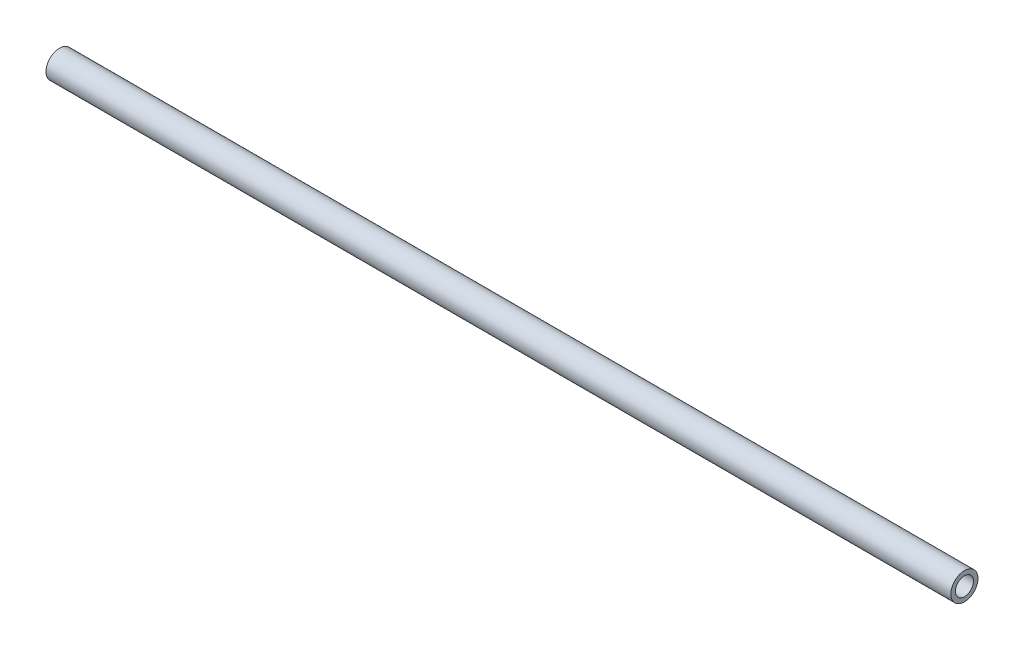
ISO-10303-21;
HEADER;
FILE_DESCRIPTION(('STEP AP214'),'2;1');
FILE_NAME('part.step','',(''),(''),'','','');
FILE_SCHEMA(('AUTOMOTIVE_DESIGN { 1 0 10303 214 1 1 1 1 }'));
ENDSEC;
DATA;
#1=APPLICATION_CONTEXT('core data for automotive mechanical design processes');
#2=APPLICATION_PROTOCOL_DEFINITION('international standard','automotive_design',2000,#1);
#3=PRODUCT_CONTEXT('',#1,'mechanical');
#4=PRODUCT('Part','Part','',(#3));
#5=PRODUCT_RELATED_PRODUCT_CATEGORY('part','',(#4));
#6=PRODUCT_DEFINITION_FORMATION('','',#4);
#7=PRODUCT_DEFINITION_CONTEXT('part definition',#1,'design');
#8=PRODUCT_DEFINITION('design','',#6,#7);
#9=PRODUCT_DEFINITION_SHAPE('','',#8);
#10=(LENGTH_UNIT() NAMED_UNIT(*) SI_UNIT(.MILLI.,.METRE.));
#11=(NAMED_UNIT(*) PLANE_ANGLE_UNIT() SI_UNIT($,.RADIAN.));
#12=(NAMED_UNIT(*) SI_UNIT($,.STERADIAN.) SOLID_ANGLE_UNIT());
#13=UNCERTAINTY_MEASURE_WITH_UNIT(LENGTH_MEASURE(1.E-05),#10,'distance_accuracy_value','');
#14=(GEOMETRIC_REPRESENTATION_CONTEXT(3) GLOBAL_UNCERTAINTY_ASSIGNED_CONTEXT((#13)) GLOBAL_UNIT_ASSIGNED_CONTEXT((#10,
#11,#12)) REPRESENTATION_CONTEXT('',''));
#15=CARTESIAN_POINT('',(0.,0.,0.));
#16=DIRECTION('',(0.,0.,1.));
#17=DIRECTION('',(1.,0.,0.));
#18=AXIS2_PLACEMENT_3D('',#15,#16,#17);
#19=CARTESIAN_POINT('',(635.,0.,0.));
#20=DIRECTION('',(1.,0.,0.));
#21=DIRECTION('',(0.,0.,-1.));
#22=AXIS2_PLACEMENT_3D('',#19,#20,#21);
#23=PLANE('',#22);
#24=CARTESIAN_POINT('',(635.,0.,0.));
#25=DIRECTION('',(1.,0.,0.));
#26=DIRECTION('',(0.,0.,-1.));
#27=AXIS2_PLACEMENT_3D('',#24,#25,#26);
#28=CIRCLE('',#27,9.525);
#29=CARTESIAN_POINT('',(635.,0.,-9.525));
#30=VERTEX_POINT('',#29);
#31=EDGE_CURVE('E10',#30,#30,#28,.T.);
#32=ORIENTED_EDGE('',*,*,#31,.T.);
#33=EDGE_LOOP('',(#32));
#34=FACE_BOUND('',#33,.T.);
#35=CARTESIAN_POINT('',(635.,0.,0.));
#36=DIRECTION('',(1.,0.,0.));
#37=DIRECTION('',(0.,0.,-1.));
#38=AXIS2_PLACEMENT_3D('',#35,#36,#37);
#39=CIRCLE('',#38,6.35);
#40=CARTESIAN_POINT('',(635.,0.,-6.35));
#41=VERTEX_POINT('',#40);
#42=EDGE_CURVE('E42',#41,#41,#39,.T.);
#43=ORIENTED_EDGE('',*,*,#42,.F.);
#44=EDGE_LOOP('',(#43));
#45=FACE_BOUND('',#44,.T.);
#46=ADVANCED_FACE('F31',(#34,#45),#23,.T.);
#47=CARTESIAN_POINT('',(0.,0.,0.));
#48=DIRECTION('',(1.,0.,0.));
#49=DIRECTION('',(0.,0.,-1.));
#50=AXIS2_PLACEMENT_3D('',#47,#48,#49);
#51=PLANE('',#50);
#52=CARTESIAN_POINT('',(0.,0.,0.));
#53=DIRECTION('',(1.,0.,0.));
#54=DIRECTION('',(0.,0.,-1.));
#55=AXIS2_PLACEMENT_3D('',#52,#53,#54);
#56=CIRCLE('',#55,9.525);
#57=CARTESIAN_POINT('',(0.,0.,-9.525));
#58=VERTEX_POINT('',#57);
#59=EDGE_CURVE('E35',#58,#58,#56,.T.);
#60=ORIENTED_EDGE('',*,*,#59,.F.);
#61=EDGE_LOOP('',(#60));
#62=FACE_BOUND('',#61,.T.);
#63=CARTESIAN_POINT('',(0.,0.,0.));
#64=DIRECTION('',(1.,0.,0.));
#65=DIRECTION('',(0.,0.,-1.));
#66=AXIS2_PLACEMENT_3D('',#63,#64,#65);
#67=CIRCLE('',#66,6.35);
#68=CARTESIAN_POINT('',(0.,0.,-6.35));
#69=VERTEX_POINT('',#68);
#70=EDGE_CURVE('E44',#69,#69,#67,.T.);
#71=ORIENTED_EDGE('',*,*,#70,.T.);
#72=EDGE_LOOP('',(#71));
#73=FACE_BOUND('',#72,.T.);
#74=ADVANCED_FACE('F54',(#62,#73),#51,.F.);
#75=CARTESIAN_POINT('',(635.,0.,0.));
#76=DIRECTION('',(-1.,0.,0.));
#77=DIRECTION('',(0.,0.,1.));
#78=AXIS2_PLACEMENT_3D('',#75,#76,#77);
#79=CYLINDRICAL_SURFACE('',#78,9.525);
#80=ORIENTED_EDGE('',*,*,#31,.F.);
#81=EDGE_LOOP('',(#80));
#82=FACE_BOUND('',#81,.T.);
#83=ORIENTED_EDGE('',*,*,#59,.T.);
#84=EDGE_LOOP('',(#83));
#85=FACE_BOUND('',#84,.T.);
#86=ADVANCED_FACE('F33',(#82,#85),#79,.T.);
#87=CARTESIAN_POINT('',(635.,0.,0.));
#88=DIRECTION('',(-1.,0.,0.));
#89=DIRECTION('',(0.,0.,1.));
#90=AXIS2_PLACEMENT_3D('',#87,#88,#89);
#91=CYLINDRICAL_SURFACE('',#90,6.35);
#92=ORIENTED_EDGE('',*,*,#42,.T.);
#93=EDGE_LOOP('',(#92));
#94=FACE_BOUND('',#93,.T.);
#95=ORIENTED_EDGE('',*,*,#70,.F.);
#96=EDGE_LOOP('',(#95));
#97=FACE_BOUND('',#96,.T.);
#98=ADVANCED_FACE('F50',(#94,#97),#91,.F.);
#99=CLOSED_SHELL('',(#46,#74,#86,#98));
#100=MANIFOLD_SOLID_BREP('B2',#99);
#101=ADVANCED_BREP_SHAPE_REPRESENTATION('',(#18,#100),#14);
#102=SHAPE_DEFINITION_REPRESENTATION(#9,#101);
ENDSEC;
END-ISO-10303-21;
